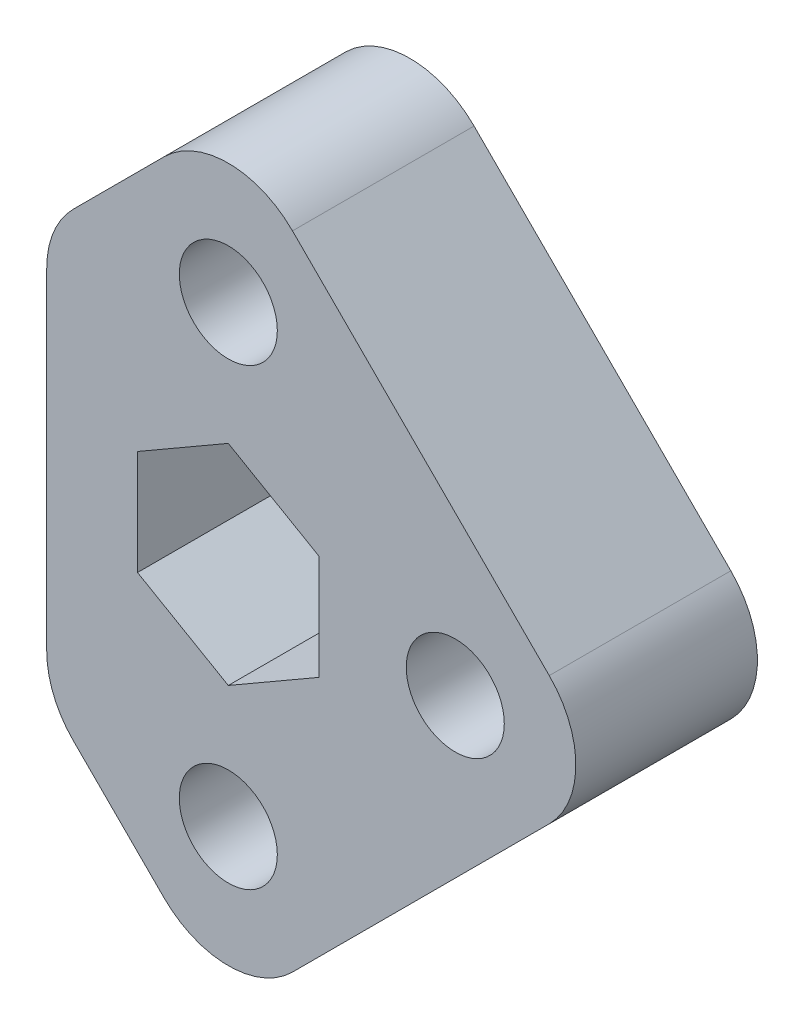
ISO-10303-21;
HEADER;
FILE_DESCRIPTION(('STEP AP214'),'2;1');
FILE_NAME('part.step','',(''),(''),'','','');
FILE_SCHEMA(('AUTOMOTIVE_DESIGN { 1 0 10303 214 1 1 1 1 }'));
ENDSEC;
DATA;
#1=APPLICATION_CONTEXT('core data for automotive mechanical design processes');
#2=APPLICATION_PROTOCOL_DEFINITION('international standard','automotive_design',2000,#1);
#3=PRODUCT_CONTEXT('',#1,'mechanical');
#4=PRODUCT('Part','Part','',(#3));
#5=PRODUCT_RELATED_PRODUCT_CATEGORY('part','',(#4));
#6=PRODUCT_DEFINITION_FORMATION('','',#4);
#7=PRODUCT_DEFINITION_CONTEXT('part definition',#1,'design');
#8=PRODUCT_DEFINITION('design','',#6,#7);
#9=PRODUCT_DEFINITION_SHAPE('','',#8);
#10=(LENGTH_UNIT() NAMED_UNIT(*) SI_UNIT(.MILLI.,.METRE.));
#11=(NAMED_UNIT(*) PLANE_ANGLE_UNIT() SI_UNIT($,.RADIAN.));
#12=(NAMED_UNIT(*) SI_UNIT($,.STERADIAN.) SOLID_ANGLE_UNIT());
#13=UNCERTAINTY_MEASURE_WITH_UNIT(LENGTH_MEASURE(1.E-05),#10,'distance_accuracy_value','');
#14=(GEOMETRIC_REPRESENTATION_CONTEXT(3) GLOBAL_UNCERTAINTY_ASSIGNED_CONTEXT((#13)) GLOBAL_UNIT_ASSIGNED_CONTEXT((#10,
#11,#12)) REPRESENTATION_CONTEXT('',''));
#15=CARTESIAN_POINT('',(0.,0.,0.));
#16=DIRECTION('',(0.,0.,1.));
#17=DIRECTION('',(1.,0.,0.));
#18=AXIS2_PLACEMENT_3D('',#15,#16,#17);
#19=CARTESIAN_POINT('',(-6.35,-11.6105122421383,12.7));
#20=DIRECTION('',(0.,0.,1.));
#21=DIRECTION('',(1.,0.,0.));
#22=AXIS2_PLACEMENT_3D('',#19,#20,#21);
#23=PLANE('',#22);
#24=CARTESIAN_POINT('',(15.8750000000004,0.,12.7));
#25=DIRECTION('',(0.,0.,1.));
#26=DIRECTION('',(1.,0.,0.));
#27=AXIS2_PLACEMENT_3D('',#24,#25,#26);
#28=CIRCLE('',#27,3.429);
#29=CARTESIAN_POINT('',(19.3040000000004,0.,12.7));
#30=VERTEX_POINT('',#29);
#31=EDGE_CURVE('E613',#30,#30,#28,.T.);
#32=ORIENTED_EDGE('',*,*,#31,.F.);
#33=EDGE_LOOP('',(#32));
#34=FACE_BOUND('',#33,.T.);
#35=DIRECTION('',(-0.866025403784438,0.5,0.));
#36=VECTOR('',#35,1.);
#37=CARTESIAN_POINT('',(6.35,3.66617420935412,12.7));
#38=LINE('',#37,#36);
#39=CARTESIAN_POINT('',(6.35,3.66617420935412,12.7));
#40=VERTEX_POINT('',#39);
#41=CARTESIAN_POINT('',(0.,7.33234841870825,12.7));
#42=VERTEX_POINT('',#41);
#43=EDGE_CURVE('E168',#40,#42,#38,.T.);
#44=ORIENTED_EDGE('',*,*,#43,.F.);
#45=DIRECTION('',(0.,1.,0.));
#46=VECTOR('',#45,1.);
#47=CARTESIAN_POINT('',(6.35,-3.66617420935413,12.7));
#48=LINE('',#47,#46);
#49=CARTESIAN_POINT('',(6.35,-3.66617420935413,12.7));
#50=VERTEX_POINT('',#49);
#51=EDGE_CURVE('E159',#50,#40,#48,.T.);
#52=ORIENTED_EDGE('',*,*,#51,.F.);
#53=DIRECTION('',(0.866025403784439,0.5,0.));
#54=VECTOR('',#53,1.);
#55=CARTESIAN_POINT('',(0.,-7.33234841870825,12.7));
#56=LINE('',#55,#54);
#57=CARTESIAN_POINT('',(0.,-7.33234841870825,12.7));
#58=VERTEX_POINT('',#57);
#59=EDGE_CURVE('E196',#58,#50,#56,.T.);
#60=ORIENTED_EDGE('',*,*,#59,.F.);
#61=DIRECTION('',(0.866025403784439,-0.5,0.));
#62=VECTOR('',#61,1.);
#63=CARTESIAN_POINT('',(-6.35,-3.66617420935412,12.7));
#64=LINE('',#63,#62);
#65=CARTESIAN_POINT('',(-6.35,-3.66617420935412,12.7));
#66=VERTEX_POINT('',#65);
#67=EDGE_CURVE('E193',#66,#58,#64,.T.);
#68=ORIENTED_EDGE('',*,*,#67,.F.);
#69=DIRECTION('',(0.,-1.,0.));
#70=VECTOR('',#69,1.);
#71=CARTESIAN_POINT('',(-6.35,3.66617420935413,12.7));
#72=LINE('',#71,#70);
#73=CARTESIAN_POINT('',(-6.35,3.66617420935413,12.7));
#74=VERTEX_POINT('',#73);
#75=EDGE_CURVE('E187',#74,#66,#72,.T.);
#76=ORIENTED_EDGE('',*,*,#75,.F.);
#77=DIRECTION('',(-0.866025403784439,-0.5,0.));
#78=VECTOR('',#77,1.);
#79=CARTESIAN_POINT('',(0.,7.33234841870825,12.7));
#80=LINE('',#79,#78);
#81=EDGE_CURVE('E183',#42,#74,#80,.T.);
#82=ORIENTED_EDGE('',*,*,#81,.F.);
#83=EDGE_LOOP('',(#44,#52,#60,#68,#76,#82));
#84=FACE_BOUND('',#83,.T.);
#85=CARTESIAN_POINT('',(-6.35,-11.6105122421383,12.7));
#86=DIRECTION('',(0.,0.,1.));
#87=DIRECTION('',(1.,0.,0.));
#88=AXIS2_PLACEMENT_3D('',#85,#86,#87);
#89=CIRCLE('',#88,6.35);
#90=CARTESIAN_POINT('',(-12.7,-11.6105122421383,12.7));
#91=VERTEX_POINT('',#90);
#92=CARTESIAN_POINT('',(-10.8401280605346,-16.1006403026729,12.7));
#93=VERTEX_POINT('',#92);
#94=EDGE_CURVE('E231',#91,#93,#89,.T.);
#95=ORIENTED_EDGE('',*,*,#94,.T.);
#96=DIRECTION('',(0.707106781186547,-0.707106781186549,0.));
#97=VECTOR('',#96,1.);
#98=CARTESIAN_POINT('',(-10.8401280605346,-16.1006403026729,12.7));
#99=LINE('',#98,#97);
#100=CARTESIAN_POINT('',(-4.49012806053461,-22.4506403026729,12.7));
#101=VERTEX_POINT('',#100);
#102=EDGE_CURVE('E235',#93,#101,#99,.T.);
#103=ORIENTED_EDGE('',*,*,#102,.T.);
#104=CARTESIAN_POINT('',(0.,-17.9605122421383,12.7));
#105=DIRECTION('',(0.,0.,1.));
#106=DIRECTION('',(1.,0.,0.));
#107=AXIS2_PLACEMENT_3D('',#104,#105,#106);
#108=CIRCLE('',#107,6.35);
#109=CARTESIAN_POINT('',(4.49012806053461,-22.4506403026729,12.7));
#110=VERTEX_POINT('',#109);
#111=EDGE_CURVE('E239',#101,#110,#108,.T.);
#112=ORIENTED_EDGE('',*,*,#111,.T.);
#113=DIRECTION('',(0.707106781186547,0.707106781186547,0.));
#114=VECTOR('',#113,1.);
#115=CARTESIAN_POINT('',(4.49012806053461,-22.4506403026729,12.7));
#116=LINE('',#115,#114);
#117=CARTESIAN_POINT('',(22.4506403026729,-4.49012806053461,12.7));
#118=VERTEX_POINT('',#117);
#119=EDGE_CURVE('E242',#110,#118,#116,.T.);
#120=ORIENTED_EDGE('',*,*,#119,.T.);
#121=CARTESIAN_POINT('',(17.9605122421383,0.,12.7));
#122=DIRECTION('',(0.,0.,1.));
#123=DIRECTION('',(1.,0.,0.));
#124=AXIS2_PLACEMENT_3D('',#121,#122,#123);
#125=CIRCLE('',#124,6.35);
#126=CARTESIAN_POINT('',(22.4506403026729,4.49012806053461,12.7));
#127=VERTEX_POINT('',#126);
#128=EDGE_CURVE('E245',#118,#127,#125,.T.);
#129=ORIENTED_EDGE('',*,*,#128,.T.);
#130=DIRECTION('',(-0.707106781186548,0.707106781186548,0.));
#131=VECTOR('',#130,1.);
#132=CARTESIAN_POINT('',(22.4506403026729,4.49012806053461,12.7));
#133=LINE('',#132,#131);
#134=CARTESIAN_POINT('',(4.49012806053462,22.4506403026729,12.7));
#135=VERTEX_POINT('',#134);
#136=EDGE_CURVE('E248',#127,#135,#133,.T.);
#137=ORIENTED_EDGE('',*,*,#136,.T.);
#138=CARTESIAN_POINT('',(0.,17.9605122421383,12.7));
#139=DIRECTION('',(0.,0.,1.));
#140=DIRECTION('',(1.,0.,0.));
#141=AXIS2_PLACEMENT_3D('',#138,#139,#140);
#142=CIRCLE('',#141,6.35);
#143=CARTESIAN_POINT('',(-4.4901280605346,22.4506403026729,12.7));
#144=VERTEX_POINT('',#143);
#145=EDGE_CURVE('E251',#135,#144,#142,.T.);
#146=ORIENTED_EDGE('',*,*,#145,.T.);
#147=DIRECTION('',(-0.707106781186547,-0.707106781186548,0.));
#148=VECTOR('',#147,1.);
#149=CARTESIAN_POINT('',(-4.4901280605346,22.4506403026729,12.7));
#150=LINE('',#149,#148);
#151=CARTESIAN_POINT('',(-10.8401280605346,16.1006403026729,12.7));
#152=VERTEX_POINT('',#151);
#153=EDGE_CURVE('E254',#144,#152,#150,.T.);
#154=ORIENTED_EDGE('',*,*,#153,.T.);
#155=CARTESIAN_POINT('',(-6.35,11.6105122421383,12.7));
#156=DIRECTION('',(0.,0.,1.));
#157=DIRECTION('',(-1.,0.,0.));
#158=AXIS2_PLACEMENT_3D('',#155,#156,#157);
#159=CIRCLE('',#158,6.35);
#160=CARTESIAN_POINT('',(-12.7,11.6105122421383,12.7));
#161=VERTEX_POINT('',#160);
#162=EDGE_CURVE('E257',#152,#161,#159,.T.);
#163=ORIENTED_EDGE('',*,*,#162,.T.);
#164=DIRECTION('',(0.,-1.,0.));
#165=VECTOR('',#164,1.);
#166=CARTESIAN_POINT('',(-12.7,11.6105122421383,12.7));
#167=LINE('',#166,#165);
#168=EDGE_CURVE('E260',#161,#91,#167,.T.);
#169=ORIENTED_EDGE('',*,*,#168,.T.);
#170=EDGE_LOOP('',(#95,#103,#112,#120,#129,#137,#146,#154,#163,#169));
#171=FACE_BOUND('',#170,.T.);
#172=CARTESIAN_POINT('',(0.,15.8750000000004,12.7));
#173=DIRECTION('',(0.,0.,1.));
#174=DIRECTION('',(1.,0.,0.));
#175=AXIS2_PLACEMENT_3D('',#172,#173,#174);
#176=CIRCLE('',#175,3.429);
#177=CARTESIAN_POINT('',(3.429,15.8750000000004,12.7));
#178=VERTEX_POINT('',#177);
#179=EDGE_CURVE('E201',#178,#178,#176,.T.);
#180=ORIENTED_EDGE('',*,*,#179,.F.);
#181=EDGE_LOOP('',(#180));
#182=FACE_BOUND('',#181,.T.);
#183=CARTESIAN_POINT('',(0.,-15.8750000000004,12.7));
#184=DIRECTION('',(0.,0.,1.));
#185=DIRECTION('',(1.,0.,0.));
#186=AXIS2_PLACEMENT_3D('',#183,#184,#185);
#187=CIRCLE('',#186,3.42900000000011);
#188=CARTESIAN_POINT('',(3.42900000000011,-15.8750000000004,12.7));
#189=VERTEX_POINT('',#188);
#190=EDGE_CURVE('E602',#189,#189,#187,.T.);
#191=ORIENTED_EDGE('',*,*,#190,.F.);
#192=EDGE_LOOP('',(#191));
#193=FACE_BOUND('',#192,.T.);
#194=ADVANCED_FACE('F45',(#34,#84,#171,#182,#193),#23,.T.);
#195=CARTESIAN_POINT('',(-6.35,-11.6105122421383,0.));
#196=DIRECTION('',(0.,0.,1.));
#197=DIRECTION('',(1.,0.,0.));
#198=AXIS2_PLACEMENT_3D('',#195,#196,#197);
#199=PLANE('',#198);
#200=CARTESIAN_POINT('',(-6.35,-11.6105122421383,0.));
#201=DIRECTION('',(0.,0.,1.));
#202=DIRECTION('',(1.,0.,0.));
#203=AXIS2_PLACEMENT_3D('',#200,#201,#202);
#204=CIRCLE('',#203,6.35);
#205=CARTESIAN_POINT('',(-12.7,-11.6105122421383,0.));
#206=VERTEX_POINT('',#205);
#207=CARTESIAN_POINT('',(-10.8401280605346,-16.1006403026729,0.));
#208=VERTEX_POINT('',#207);
#209=EDGE_CURVE('E177',#206,#208,#204,.T.);
#210=ORIENTED_EDGE('',*,*,#209,.F.);
#211=DIRECTION('',(0.,-1.,0.));
#212=VECTOR('',#211,1.);
#213=CARTESIAN_POINT('',(-12.7,11.6105122421383,0.));
#214=LINE('',#213,#212);
#215=CARTESIAN_POINT('',(-12.7,11.6105122421383,0.));
#216=VERTEX_POINT('',#215);
#217=EDGE_CURVE('E236',#216,#206,#214,.T.);
#218=ORIENTED_EDGE('',*,*,#217,.F.);
#219=CARTESIAN_POINT('',(-6.35,11.6105122421383,0.));
#220=DIRECTION('',(0.,0.,1.));
#221=DIRECTION('',(-1.,0.,0.));
#222=AXIS2_PLACEMENT_3D('',#219,#220,#221);
#223=CIRCLE('',#222,6.35);
#224=CARTESIAN_POINT('',(-10.8401280605346,16.1006403026729,0.));
#225=VERTEX_POINT('',#224);
#226=EDGE_CURVE('E288',#225,#216,#223,.T.);
#227=ORIENTED_EDGE('',*,*,#226,.F.);
#228=DIRECTION('',(-0.707106781186547,-0.707106781186548,0.));
#229=VECTOR('',#228,1.);
#230=CARTESIAN_POINT('',(-4.4901280605346,22.4506403026729,0.));
#231=LINE('',#230,#229);
#232=CARTESIAN_POINT('',(-4.4901280605346,22.4506403026729,0.));
#233=VERTEX_POINT('',#232);
#234=EDGE_CURVE('E285',#233,#225,#231,.T.);
#235=ORIENTED_EDGE('',*,*,#234,.F.);
#236=CARTESIAN_POINT('',(0.,17.9605122421383,0.));
#237=DIRECTION('',(0.,0.,1.));
#238=DIRECTION('',(1.,0.,0.));
#239=AXIS2_PLACEMENT_3D('',#236,#237,#238);
#240=CIRCLE('',#239,6.35);
#241=CARTESIAN_POINT('',(4.49012806053462,22.4506403026729,0.));
#242=VERTEX_POINT('',#241);
#243=EDGE_CURVE('E282',#242,#233,#240,.T.);
#244=ORIENTED_EDGE('',*,*,#243,.F.);
#245=DIRECTION('',(-0.707106781186548,0.707106781186548,0.));
#246=VECTOR('',#245,1.);
#247=CARTESIAN_POINT('',(22.4506403026729,4.49012806053461,0.));
#248=LINE('',#247,#246);
#249=CARTESIAN_POINT('',(22.4506403026729,4.49012806053461,0.));
#250=VERTEX_POINT('',#249);
#251=EDGE_CURVE('E279',#250,#242,#248,.T.);
#252=ORIENTED_EDGE('',*,*,#251,.F.);
#253=CARTESIAN_POINT('',(17.9605122421383,0.,0.));
#254=DIRECTION('',(0.,0.,1.));
#255=DIRECTION('',(1.,0.,0.));
#256=AXIS2_PLACEMENT_3D('',#253,#254,#255);
#257=CIRCLE('',#256,6.35);
#258=CARTESIAN_POINT('',(22.4506403026729,-4.49012806053461,0.));
#259=VERTEX_POINT('',#258);
#260=EDGE_CURVE('E276',#259,#250,#257,.T.);
#261=ORIENTED_EDGE('',*,*,#260,.F.);
#262=DIRECTION('',(0.707106781186547,0.707106781186547,0.));
#263=VECTOR('',#262,1.);
#264=CARTESIAN_POINT('',(4.49012806053461,-22.4506403026729,0.));
#265=LINE('',#264,#263);
#266=CARTESIAN_POINT('',(4.49012806053461,-22.4506403026729,0.));
#267=VERTEX_POINT('',#266);
#268=EDGE_CURVE('E273',#267,#259,#265,.T.);
#269=ORIENTED_EDGE('',*,*,#268,.F.);
#270=CARTESIAN_POINT('',(0.,-17.9605122421383,0.));
#271=DIRECTION('',(0.,0.,1.));
#272=DIRECTION('',(1.,0.,0.));
#273=AXIS2_PLACEMENT_3D('',#270,#271,#272);
#274=CIRCLE('',#273,6.35);
#275=CARTESIAN_POINT('',(-4.49012806053461,-22.4506403026729,0.));
#276=VERTEX_POINT('',#275);
#277=EDGE_CURVE('E270',#276,#267,#274,.T.);
#278=ORIENTED_EDGE('',*,*,#277,.F.);
#279=DIRECTION('',(0.707106781186547,-0.707106781186549,0.));
#280=VECTOR('',#279,1.);
#281=CARTESIAN_POINT('',(-10.8401280605346,-16.1006403026729,0.));
#282=LINE('',#281,#280);
#283=EDGE_CURVE('E267',#208,#276,#282,.T.);
#284=ORIENTED_EDGE('',*,*,#283,.F.);
#285=EDGE_LOOP('',(#210,#218,#227,#235,#244,#252,#261,#269,#278,#284));
#286=FACE_BOUND('',#285,.T.);
#287=DIRECTION('',(0.,1.,0.));
#288=VECTOR('',#287,1.);
#289=CARTESIAN_POINT('',(6.35,-3.66617420935413,0.));
#290=LINE('',#289,#288);
#291=CARTESIAN_POINT('',(6.35,-3.66617420935413,0.));
#292=VERTEX_POINT('',#291);
#293=CARTESIAN_POINT('',(6.35,3.66617420935412,0.));
#294=VERTEX_POINT('',#293);
#295=EDGE_CURVE('E69',#292,#294,#290,.T.);
#296=ORIENTED_EDGE('',*,*,#295,.T.);
#297=DIRECTION('',(-0.866025403784438,0.5,0.));
#298=VECTOR('',#297,1.);
#299=CARTESIAN_POINT('',(6.35,3.66617420935412,0.));
#300=LINE('',#299,#298);
#301=CARTESIAN_POINT('',(0.,7.33234841870825,0.));
#302=VERTEX_POINT('',#301);
#303=EDGE_CURVE('E175',#294,#302,#300,.T.);
#304=ORIENTED_EDGE('',*,*,#303,.T.);
#305=DIRECTION('',(-0.866025403784439,-0.5,0.));
#306=VECTOR('',#305,1.);
#307=CARTESIAN_POINT('',(0.,7.33234841870825,0.));
#308=LINE('',#307,#306);
#309=CARTESIAN_POINT('',(-6.35,3.66617420935413,0.));
#310=VERTEX_POINT('',#309);
#311=EDGE_CURVE('E204',#302,#310,#308,.T.);
#312=ORIENTED_EDGE('',*,*,#311,.T.);
#313=DIRECTION('',(0.,-1.,0.));
#314=VECTOR('',#313,1.);
#315=CARTESIAN_POINT('',(-6.35,3.66617420935413,0.));
#316=LINE('',#315,#314);
#317=CARTESIAN_POINT('',(-6.35,-3.66617420935412,0.));
#318=VERTEX_POINT('',#317);
#319=EDGE_CURVE('E208',#310,#318,#316,.T.);
#320=ORIENTED_EDGE('',*,*,#319,.T.);
#321=DIRECTION('',(0.866025403784439,-0.5,0.));
#322=VECTOR('',#321,1.);
#323=CARTESIAN_POINT('',(-6.35,-3.66617420935412,0.));
#324=LINE('',#323,#322);
#325=CARTESIAN_POINT('',(0.,-7.33234841870825,0.));
#326=VERTEX_POINT('',#325);
#327=EDGE_CURVE('E212',#318,#326,#324,.T.);
#328=ORIENTED_EDGE('',*,*,#327,.T.);
#329=DIRECTION('',(0.866025403784439,0.5,0.));
#330=VECTOR('',#329,1.);
#331=CARTESIAN_POINT('',(0.,-7.33234841870825,0.));
#332=LINE('',#331,#330);
#333=EDGE_CURVE('E169',#326,#292,#332,.T.);
#334=ORIENTED_EDGE('',*,*,#333,.T.);
#335=EDGE_LOOP('',(#296,#304,#312,#320,#328,#334));
#336=FACE_BOUND('',#335,.T.);
#337=CARTESIAN_POINT('',(0.,15.8750000000004,0.));
#338=DIRECTION('',(0.,0.,1.));
#339=DIRECTION('',(1.,0.,0.));
#340=AXIS2_PLACEMENT_3D('',#337,#338,#339);
#341=CIRCLE('',#340,3.429);
#342=CARTESIAN_POINT('',(3.429,15.8750000000004,0.));
#343=VERTEX_POINT('',#342);
#344=EDGE_CURVE('E617',#343,#343,#341,.T.);
#345=ORIENTED_EDGE('',*,*,#344,.T.);
#346=EDGE_LOOP('',(#345));
#347=FACE_BOUND('',#346,.T.);
#348=CARTESIAN_POINT('',(15.8750000000004,0.,0.));
#349=DIRECTION('',(0.,0.,1.));
#350=DIRECTION('',(1.,0.,0.));
#351=AXIS2_PLACEMENT_3D('',#348,#349,#350);
#352=CIRCLE('',#351,3.429);
#353=CARTESIAN_POINT('',(19.3040000000004,0.,0.));
#354=VERTEX_POINT('',#353);
#355=EDGE_CURVE('E610',#354,#354,#352,.T.);
#356=ORIENTED_EDGE('',*,*,#355,.T.);
#357=EDGE_LOOP('',(#356));
#358=FACE_BOUND('',#357,.T.);
#359=CARTESIAN_POINT('',(0.,-15.8750000000004,0.));
#360=DIRECTION('',(0.,0.,1.));
#361=DIRECTION('',(1.,0.,0.));
#362=AXIS2_PLACEMENT_3D('',#359,#360,#361);
#363=CIRCLE('',#362,3.42900000000011);
#364=CARTESIAN_POINT('',(3.42900000000011,-15.8750000000004,0.));
#365=VERTEX_POINT('',#364);
#366=EDGE_CURVE('E605',#365,#365,#363,.T.);
#367=ORIENTED_EDGE('',*,*,#366,.T.);
#368=EDGE_LOOP('',(#367));
#369=FACE_BOUND('',#368,.T.);
#370=ADVANCED_FACE('F335',(#286,#336,#347,#358,#369),#199,.F.);
#371=CARTESIAN_POINT('',(-6.35,-11.6105122421383,12.7));
#372=DIRECTION('',(0.,0.,-1.));
#373=DIRECTION('',(-1.,0.,0.));
#374=AXIS2_PLACEMENT_3D('',#371,#372,#373);
#375=CYLINDRICAL_SURFACE('',#374,6.35);
#376=ORIENTED_EDGE('',*,*,#209,.T.);
#377=DIRECTION('',(0.,0.,-1.));
#378=VECTOR('',#377,1.);
#379=CARTESIAN_POINT('',(-10.8401280605346,-16.1006403026729,12.7));
#380=LINE('',#379,#378);
#381=EDGE_CURVE('E11',#93,#208,#380,.T.);
#382=ORIENTED_EDGE('',*,*,#381,.F.);
#383=ORIENTED_EDGE('',*,*,#94,.F.);
#384=DIRECTION('',(0.,0.,-1.));
#385=VECTOR('',#384,1.);
#386=CARTESIAN_POINT('',(-12.7,-11.6105122421383,12.7));
#387=LINE('',#386,#385);
#388=EDGE_CURVE('E263',#91,#206,#387,.T.);
#389=ORIENTED_EDGE('',*,*,#388,.T.);
#390=EDGE_LOOP('',(#376,#382,#383,#389));
#391=FACE_BOUND('',#390,.T.);
#392=ADVANCED_FACE('F47',(#391),#375,.T.);
#393=CARTESIAN_POINT('',(-10.8401280605346,-16.1006403026729,12.7));
#394=DIRECTION('',(0.707106781186549,0.707106781186546,0.));
#395=DIRECTION('',(-0.707106781186546,0.707106781186549,0.));
#396=AXIS2_PLACEMENT_3D('',#393,#394,#395);
#397=PLANE('',#396);
#398=ORIENTED_EDGE('',*,*,#283,.T.);
#399=DIRECTION('',(0.,0.,-1.));
#400=VECTOR('',#399,1.);
#401=CARTESIAN_POINT('',(-4.49012806053461,-22.4506403026729,12.7));
#402=LINE('',#401,#400);
#403=EDGE_CURVE('E54',#101,#276,#402,.T.);
#404=ORIENTED_EDGE('',*,*,#403,.F.);
#405=ORIENTED_EDGE('',*,*,#102,.F.);
#406=ORIENTED_EDGE('',*,*,#381,.T.);
#407=EDGE_LOOP('',(#398,#404,#405,#406));
#408=FACE_BOUND('',#407,.T.);
#409=ADVANCED_FACE('F352',(#408),#397,.F.);
#410=CARTESIAN_POINT('',(0.,-17.9605122421383,12.7));
#411=DIRECTION('',(0.,0.,-1.));
#412=DIRECTION('',(-1.,0.,0.));
#413=AXIS2_PLACEMENT_3D('',#410,#411,#412);
#414=CYLINDRICAL_SURFACE('',#413,6.35);
#415=ORIENTED_EDGE('',*,*,#277,.T.);
#416=DIRECTION('',(0.,0.,-1.));
#417=VECTOR('',#416,1.);
#418=CARTESIAN_POINT('',(4.49012806053461,-22.4506403026729,12.7));
#419=LINE('',#418,#417);
#420=EDGE_CURVE('E320',#110,#267,#419,.T.);
#421=ORIENTED_EDGE('',*,*,#420,.F.);
#422=ORIENTED_EDGE('',*,*,#111,.F.);
#423=ORIENTED_EDGE('',*,*,#403,.T.);
#424=EDGE_LOOP('',(#415,#421,#422,#423));
#425=FACE_BOUND('',#424,.T.);
#426=ADVANCED_FACE('F329',(#425),#414,.T.);
#427=CARTESIAN_POINT('',(4.49012806053461,-22.4506403026729,12.7));
#428=DIRECTION('',(-0.707106781186548,0.707106781186548,0.));
#429=DIRECTION('',(-0.707106781186548,-0.707106781186548,0.));
#430=AXIS2_PLACEMENT_3D('',#427,#428,#429);
#431=PLANE('',#430);
#432=ORIENTED_EDGE('',*,*,#268,.T.);
#433=DIRECTION('',(0.,0.,-1.));
#434=VECTOR('',#433,1.);
#435=CARTESIAN_POINT('',(22.4506403026729,-4.49012806053461,12.7));
#436=LINE('',#435,#434);
#437=EDGE_CURVE('E316',#118,#259,#436,.T.);
#438=ORIENTED_EDGE('',*,*,#437,.F.);
#439=ORIENTED_EDGE('',*,*,#119,.F.);
#440=ORIENTED_EDGE('',*,*,#420,.T.);
#441=EDGE_LOOP('',(#432,#438,#439,#440));
#442=FACE_BOUND('',#441,.T.);
#443=ADVANCED_FACE('F341',(#442),#431,.F.);
#444=CARTESIAN_POINT('',(17.9605122421383,0.,12.7));
#445=DIRECTION('',(0.,0.,-1.));
#446=DIRECTION('',(-1.,0.,0.));
#447=AXIS2_PLACEMENT_3D('',#444,#445,#446);
#448=CYLINDRICAL_SURFACE('',#447,6.35);
#449=ORIENTED_EDGE('',*,*,#260,.T.);
#450=DIRECTION('',(0.,0.,-1.));
#451=VECTOR('',#450,1.);
#452=CARTESIAN_POINT('',(22.4506403026729,4.49012806053461,12.7));
#453=LINE('',#452,#451);
#454=EDGE_CURVE('E312',#127,#250,#453,.T.);
#455=ORIENTED_EDGE('',*,*,#454,.F.);
#456=ORIENTED_EDGE('',*,*,#128,.F.);
#457=ORIENTED_EDGE('',*,*,#437,.T.);
#458=EDGE_LOOP('',(#449,#455,#456,#457));
#459=FACE_BOUND('',#458,.T.);
#460=ADVANCED_FACE('F345',(#459),#448,.T.);
#461=CARTESIAN_POINT('',(22.4506403026729,4.49012806053461,12.7));
#462=DIRECTION('',(-0.707106781186548,-0.707106781186548,0.));
#463=DIRECTION('',(0.707106781186548,-0.707106781186548,0.));
#464=AXIS2_PLACEMENT_3D('',#461,#462,#463);
#465=PLANE('',#464);
#466=ORIENTED_EDGE('',*,*,#251,.T.);
#467=DIRECTION('',(0.,0.,-1.));
#468=VECTOR('',#467,1.);
#469=CARTESIAN_POINT('',(4.49012806053462,22.4506403026729,12.7));
#470=LINE('',#469,#468);
#471=EDGE_CURVE('E308',#135,#242,#470,.T.);
#472=ORIENTED_EDGE('',*,*,#471,.F.);
#473=ORIENTED_EDGE('',*,*,#136,.F.);
#474=ORIENTED_EDGE('',*,*,#454,.T.);
#475=EDGE_LOOP('',(#466,#472,#473,#474));
#476=FACE_BOUND('',#475,.T.);
#477=ADVANCED_FACE('F375',(#476),#465,.F.);
#478=CARTESIAN_POINT('',(0.,17.9605122421383,12.7));
#479=DIRECTION('',(0.,0.,-1.));
#480=DIRECTION('',(-1.,0.,0.));
#481=AXIS2_PLACEMENT_3D('',#478,#479,#480);
#482=CYLINDRICAL_SURFACE('',#481,6.35);
#483=ORIENTED_EDGE('',*,*,#243,.T.);
#484=DIRECTION('',(0.,0.,-1.));
#485=VECTOR('',#484,1.);
#486=CARTESIAN_POINT('',(-4.4901280605346,22.4506403026729,12.7));
#487=LINE('',#486,#485);
#488=EDGE_CURVE('E304',#144,#233,#487,.T.);
#489=ORIENTED_EDGE('',*,*,#488,.F.);
#490=ORIENTED_EDGE('',*,*,#145,.F.);
#491=ORIENTED_EDGE('',*,*,#471,.T.);
#492=EDGE_LOOP('',(#483,#489,#490,#491));
#493=FACE_BOUND('',#492,.T.);
#494=ADVANCED_FACE('F372',(#493),#482,.T.);
#495=CARTESIAN_POINT('',(-4.4901280605346,22.4506403026729,12.7));
#496=DIRECTION('',(0.707106781186548,-0.707106781186547,0.));
#497=DIRECTION('',(0.707106781186547,0.707106781186548,0.));
#498=AXIS2_PLACEMENT_3D('',#495,#496,#497);
#499=PLANE('',#498);
#500=ORIENTED_EDGE('',*,*,#234,.T.);
#501=DIRECTION('',(0.,0.,-1.));
#502=VECTOR('',#501,1.);
#503=CARTESIAN_POINT('',(-10.8401280605346,16.1006403026729,12.7));
#504=LINE('',#503,#502);
#505=EDGE_CURVE('E300',#152,#225,#504,.T.);
#506=ORIENTED_EDGE('',*,*,#505,.F.);
#507=ORIENTED_EDGE('',*,*,#153,.F.);
#508=ORIENTED_EDGE('',*,*,#488,.T.);
#509=EDGE_LOOP('',(#500,#506,#507,#508));
#510=FACE_BOUND('',#509,.T.);
#511=ADVANCED_FACE('F368',(#510),#499,.F.);
#512=CARTESIAN_POINT('',(-6.35,11.6105122421383,12.7));
#513=DIRECTION('',(0.,0.,-1.));
#514=DIRECTION('',(-1.,0.,0.));
#515=AXIS2_PLACEMENT_3D('',#512,#513,#514);
#516=CYLINDRICAL_SURFACE('',#515,6.35);
#517=ORIENTED_EDGE('',*,*,#226,.T.);
#518=DIRECTION('',(0.,0.,-1.));
#519=VECTOR('',#518,1.);
#520=CARTESIAN_POINT('',(-12.7,11.6105122421383,12.7));
#521=LINE('',#520,#519);
#522=EDGE_CURVE('E296',#161,#216,#521,.T.);
#523=ORIENTED_EDGE('',*,*,#522,.F.);
#524=ORIENTED_EDGE('',*,*,#162,.F.);
#525=ORIENTED_EDGE('',*,*,#505,.T.);
#526=EDGE_LOOP('',(#517,#523,#524,#525));
#527=FACE_BOUND('',#526,.T.);
#528=ADVANCED_FACE('F364',(#527),#516,.T.);
#529=CARTESIAN_POINT('',(-12.7,11.6105122421383,12.7));
#530=DIRECTION('',(1.,0.,0.));
#531=DIRECTION('',(0.,1.,0.));
#532=AXIS2_PLACEMENT_3D('',#529,#530,#531);
#533=PLANE('',#532);
#534=ORIENTED_EDGE('',*,*,#217,.T.);
#535=ORIENTED_EDGE('',*,*,#388,.F.);
#536=ORIENTED_EDGE('',*,*,#168,.F.);
#537=ORIENTED_EDGE('',*,*,#522,.T.);
#538=EDGE_LOOP('',(#534,#535,#536,#537));
#539=FACE_BOUND('',#538,.T.);
#540=ADVANCED_FACE('F359',(#539),#533,.F.);
#541=CARTESIAN_POINT('',(6.35,-3.66617420935413,12.7));
#542=DIRECTION('',(-1.,0.,0.));
#543=DIRECTION('',(0.,-1.,0.));
#544=AXIS2_PLACEMENT_3D('',#541,#542,#543);
#545=PLANE('',#544);
#546=ORIENTED_EDGE('',*,*,#295,.F.);
#547=DIRECTION('',(0.,0.,-1.));
#548=VECTOR('',#547,1.);
#549=CARTESIAN_POINT('',(6.35,-3.66617420935413,12.7));
#550=LINE('',#549,#548);
#551=EDGE_CURVE('E163',#50,#292,#550,.T.);
#552=ORIENTED_EDGE('',*,*,#551,.F.);
#553=ORIENTED_EDGE('',*,*,#51,.T.);
#554=DIRECTION('',(0.,0.,-1.));
#555=VECTOR('',#554,1.);
#556=CARTESIAN_POINT('',(6.35,3.66617420935412,12.7));
#557=LINE('',#556,#555);
#558=EDGE_CURVE('E162',#40,#294,#557,.T.);
#559=ORIENTED_EDGE('',*,*,#558,.T.);
#560=EDGE_LOOP('',(#546,#552,#553,#559));
#561=FACE_BOUND('',#560,.T.);
#562=ADVANCED_FACE('F161',(#561),#545,.T.);
#563=CARTESIAN_POINT('',(6.35,3.66617420935412,12.7));
#564=DIRECTION('',(-0.5,-0.866025403784438,0.));
#565=DIRECTION('',(0.866025403784438,-0.5,0.));
#566=AXIS2_PLACEMENT_3D('',#563,#564,#565);
#567=PLANE('',#566);
#568=ORIENTED_EDGE('',*,*,#303,.F.);
#569=ORIENTED_EDGE('',*,*,#558,.F.);
#570=ORIENTED_EDGE('',*,*,#43,.T.);
#571=DIRECTION('',(0.,0.,-1.));
#572=VECTOR('',#571,1.);
#573=CARTESIAN_POINT('',(0.,7.33234841870825,12.7));
#574=LINE('',#573,#572);
#575=EDGE_CURVE('E178',#42,#302,#574,.T.);
#576=ORIENTED_EDGE('',*,*,#575,.T.);
#577=EDGE_LOOP('',(#568,#569,#570,#576));
#578=FACE_BOUND('',#577,.T.);
#579=ADVANCED_FACE('F172',(#578),#567,.T.);
#580=CARTESIAN_POINT('',(0.,7.33234841870825,12.7));
#581=DIRECTION('',(0.5,-0.866025403784439,0.));
#582=DIRECTION('',(0.866025403784439,0.5,0.));
#583=AXIS2_PLACEMENT_3D('',#580,#581,#582);
#584=PLANE('',#583);
#585=ORIENTED_EDGE('',*,*,#311,.F.);
#586=ORIENTED_EDGE('',*,*,#575,.F.);
#587=ORIENTED_EDGE('',*,*,#81,.T.);
#588=DIRECTION('',(0.,0.,-1.));
#589=VECTOR('',#588,1.);
#590=CARTESIAN_POINT('',(-6.35,3.66617420935413,12.7));
#591=LINE('',#590,#589);
#592=EDGE_CURVE('E226',#74,#310,#591,.T.);
#593=ORIENTED_EDGE('',*,*,#592,.T.);
#594=EDGE_LOOP('',(#585,#586,#587,#593));
#595=FACE_BOUND('',#594,.T.);
#596=ADVANCED_FACE('F423',(#595),#584,.T.);
#597=CARTESIAN_POINT('',(-6.35,3.66617420935413,12.7));
#598=DIRECTION('',(1.,0.,0.));
#599=DIRECTION('',(0.,1.,0.));
#600=AXIS2_PLACEMENT_3D('',#597,#598,#599);
#601=PLANE('',#600);
#602=ORIENTED_EDGE('',*,*,#319,.F.);
#603=ORIENTED_EDGE('',*,*,#592,.F.);
#604=ORIENTED_EDGE('',*,*,#75,.T.);
#605=DIRECTION('',(0.,0.,-1.));
#606=VECTOR('',#605,1.);
#607=CARTESIAN_POINT('',(-6.35,-3.66617420935412,12.7));
#608=LINE('',#607,#606);
#609=EDGE_CURVE('E223',#66,#318,#608,.T.);
#610=ORIENTED_EDGE('',*,*,#609,.T.);
#611=EDGE_LOOP('',(#602,#603,#604,#610));
#612=FACE_BOUND('',#611,.T.);
#613=ADVANCED_FACE('F429',(#612),#601,.T.);
#614=CARTESIAN_POINT('',(-6.35,-3.66617420935412,12.7));
#615=DIRECTION('',(0.5,0.866025403784438,0.));
#616=DIRECTION('',(-0.866025403784439,0.5,0.));
#617=AXIS2_PLACEMENT_3D('',#614,#615,#616);
#618=PLANE('',#617);
#619=ORIENTED_EDGE('',*,*,#327,.F.);
#620=ORIENTED_EDGE('',*,*,#609,.F.);
#621=ORIENTED_EDGE('',*,*,#67,.T.);
#622=DIRECTION('',(0.,0.,-1.));
#623=VECTOR('',#622,1.);
#624=CARTESIAN_POINT('',(0.,-7.33234841870825,12.7));
#625=LINE('',#624,#623);
#626=EDGE_CURVE('E61',#58,#326,#625,.T.);
#627=ORIENTED_EDGE('',*,*,#626,.T.);
#628=EDGE_LOOP('',(#619,#620,#621,#627));
#629=FACE_BOUND('',#628,.T.);
#630=ADVANCED_FACE('F437',(#629),#618,.T.);
#631=CARTESIAN_POINT('',(0.,-7.33234841870825,12.7));
#632=DIRECTION('',(-0.5,0.866025403784439,0.));
#633=DIRECTION('',(-0.866025403784439,-0.5,0.));
#634=AXIS2_PLACEMENT_3D('',#631,#632,#633);
#635=PLANE('',#634);
#636=ORIENTED_EDGE('',*,*,#333,.F.);
#637=ORIENTED_EDGE('',*,*,#626,.F.);
#638=ORIENTED_EDGE('',*,*,#59,.T.);
#639=ORIENTED_EDGE('',*,*,#551,.T.);
#640=EDGE_LOOP('',(#636,#637,#638,#639));
#641=FACE_BOUND('',#640,.T.);
#642=ADVANCED_FACE('F445',(#641),#635,.T.);
#643=CARTESIAN_POINT('',(0.,15.8750000000004,12.7));
#644=DIRECTION('',(0.,0.,-1.));
#645=DIRECTION('',(-1.,0.,0.));
#646=AXIS2_PLACEMENT_3D('',#643,#644,#645);
#647=CYLINDRICAL_SURFACE('',#646,3.429);
#648=ORIENTED_EDGE('',*,*,#179,.T.);
#649=EDGE_LOOP('',(#648));
#650=FACE_BOUND('',#649,.T.);
#651=ORIENTED_EDGE('',*,*,#344,.F.);
#652=EDGE_LOOP('',(#651));
#653=FACE_BOUND('',#652,.T.);
#654=ADVANCED_FACE('F453',(#650,#653),#647,.F.);
#655=CARTESIAN_POINT('',(15.8750000000004,0.,12.7));
#656=DIRECTION('',(0.,0.,-1.));
#657=DIRECTION('',(-1.,0.,0.));
#658=AXIS2_PLACEMENT_3D('',#655,#656,#657);
#659=CYLINDRICAL_SURFACE('',#658,3.429);
#660=ORIENTED_EDGE('',*,*,#31,.T.);
#661=EDGE_LOOP('',(#660));
#662=FACE_BOUND('',#661,.T.);
#663=ORIENTED_EDGE('',*,*,#355,.F.);
#664=EDGE_LOOP('',(#663));
#665=FACE_BOUND('',#664,.T.);
#666=ADVANCED_FACE('F460',(#662,#665),#659,.F.);
#667=CARTESIAN_POINT('',(0.,-15.8750000000004,12.7));
#668=DIRECTION('',(0.,0.,-1.));
#669=DIRECTION('',(-1.,0.,0.));
#670=AXIS2_PLACEMENT_3D('',#667,#668,#669);
#671=CYLINDRICAL_SURFACE('',#670,3.42900000000011);
#672=ORIENTED_EDGE('',*,*,#190,.T.);
#673=EDGE_LOOP('',(#672));
#674=FACE_BOUND('',#673,.T.);
#675=ORIENTED_EDGE('',*,*,#366,.F.);
#676=EDGE_LOOP('',(#675));
#677=FACE_BOUND('',#676,.T.);
#678=ADVANCED_FACE('F468',(#674,#677),#671,.F.);
#679=CLOSED_SHELL('',(#194,#370,#392,#409,#426,#443,#460,#477,#494,#511,#528,#540,#562,#579,
#596,#613,#630,#642,#654,#666,#678));
#680=MANIFOLD_SOLID_BREP('B2',#679);
#681=ADVANCED_BREP_SHAPE_REPRESENTATION('',(#18,#680),#14);
#682=SHAPE_DEFINITION_REPRESENTATION(#9,#681);
ENDSEC;
END-ISO-10303-21;
